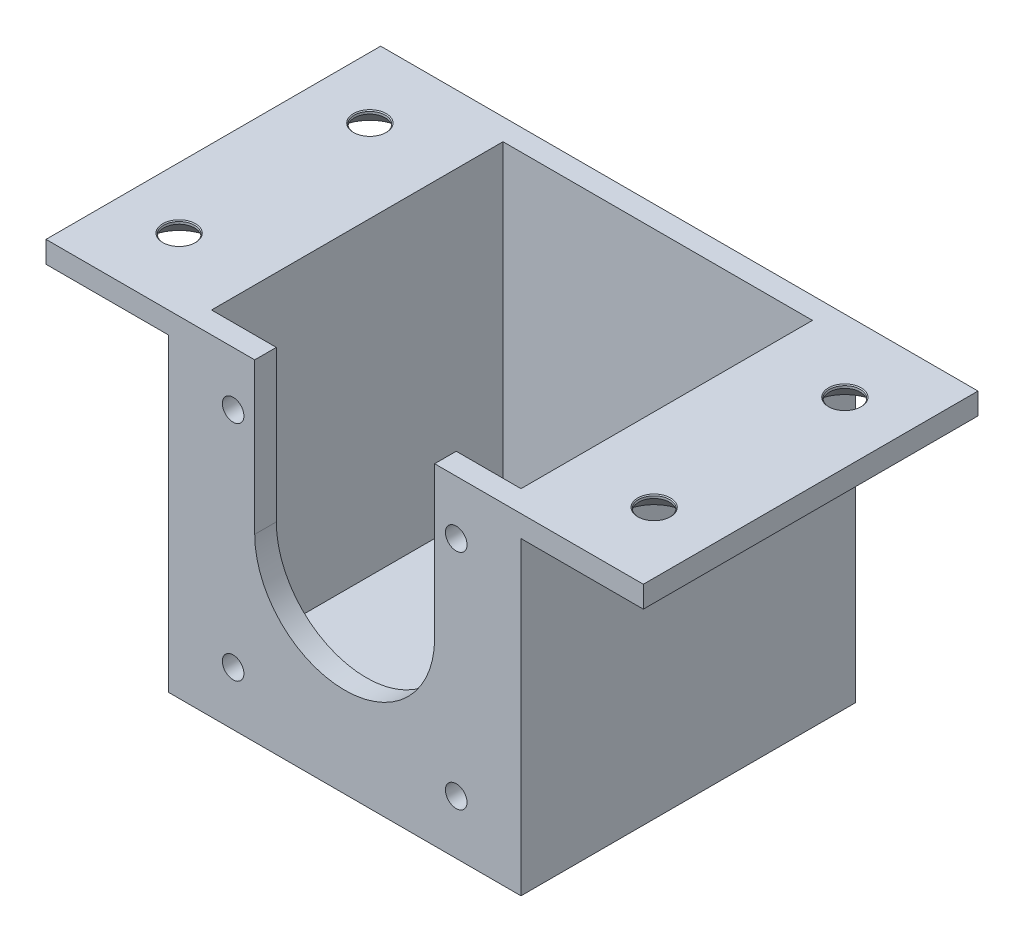
ISO-10303-21;
HEADER;
FILE_DESCRIPTION(('STEP AP214'),'2;1');
FILE_NAME('part.step','',(''),(''),'','','');
FILE_SCHEMA(('AUTOMOTIVE_DESIGN { 1 0 10303 214 1 1 1 1 }'));
ENDSEC;
DATA;
#1=APPLICATION_CONTEXT('core data for automotive mechanical design processes');
#2=APPLICATION_PROTOCOL_DEFINITION('international standard','automotive_design',2000,#1);
#3=PRODUCT_CONTEXT('',#1,'mechanical');
#4=PRODUCT('Part','Part','',(#3));
#5=PRODUCT_RELATED_PRODUCT_CATEGORY('part','',(#4));
#6=PRODUCT_DEFINITION_FORMATION('','',#4);
#7=PRODUCT_DEFINITION_CONTEXT('part definition',#1,'design');
#8=PRODUCT_DEFINITION('design','',#6,#7);
#9=PRODUCT_DEFINITION_SHAPE('','',#8);
#10=(LENGTH_UNIT() NAMED_UNIT(*) SI_UNIT(.MILLI.,.METRE.));
#11=(NAMED_UNIT(*) PLANE_ANGLE_UNIT() SI_UNIT($,.RADIAN.));
#12=(NAMED_UNIT(*) SI_UNIT($,.STERADIAN.) SOLID_ANGLE_UNIT());
#13=UNCERTAINTY_MEASURE_WITH_UNIT(LENGTH_MEASURE(1.E-05),#10,'distance_accuracy_value','');
#14=(GEOMETRIC_REPRESENTATION_CONTEXT(3) GLOBAL_UNCERTAINTY_ASSIGNED_CONTEXT((#13)) GLOBAL_UNIT_ASSIGNED_CONTEXT((#10,
#11,#12)) REPRESENTATION_CONTEXT('',''));
#15=CARTESIAN_POINT('',(0.,0.,0.));
#16=DIRECTION('',(0.,0.,1.));
#17=DIRECTION('',(1.,0.,0.));
#18=AXIS2_PLACEMENT_3D('',#15,#16,#17);
#19=CARTESIAN_POINT('',(0.,0.,46.5));
#20=DIRECTION('',(-1.,0.,0.));
#21=DIRECTION('',(0.,0.,1.));
#22=AXIS2_PLACEMENT_3D('',#19,#20,#21);
#23=PLANE('',#22);
#24=DIRECTION('',(0.,0.,-1.));
#25=VECTOR('',#24,1.);
#26=CARTESIAN_POINT('',(0.,0.,46.5));
#27=LINE('',#26,#25);
#28=CARTESIAN_POINT('',(0.,0.,43.5));
#29=VERTEX_POINT('',#28);
#30=CARTESIAN_POINT('',(0.,0.,3.));
#31=VERTEX_POINT('',#30);
#32=EDGE_CURVE('E394',#29,#31,#27,.T.);
#33=ORIENTED_EDGE('',*,*,#32,.F.);
#34=DIRECTION('',(0.,-1.,0.));
#35=VECTOR('',#34,1.);
#36=CARTESIAN_POINT('',(0.,43.,43.5));
#37=LINE('',#36,#35);
#38=CARTESIAN_POINT('',(0.,43.,43.5));
#39=VERTEX_POINT('',#38);
#40=EDGE_CURVE('E313',#39,#29,#37,.T.);
#41=ORIENTED_EDGE('',*,*,#40,.F.);
#42=DIRECTION('',(0.,0.,-1.));
#43=VECTOR('',#42,1.);
#44=CARTESIAN_POINT('',(0.,43.,46.5));
#45=LINE('',#44,#43);
#46=CARTESIAN_POINT('',(0.,43.,3.));
#47=VERTEX_POINT('',#46);
#48=EDGE_CURVE('E397',#39,#47,#45,.T.);
#49=ORIENTED_EDGE('',*,*,#48,.T.);
#50=DIRECTION('',(0.,-1.,0.));
#51=VECTOR('',#50,1.);
#52=CARTESIAN_POINT('',(0.,43.,3.));
#53=LINE('',#52,#51);
#54=EDGE_CURVE('E325',#47,#31,#53,.T.);
#55=ORIENTED_EDGE('',*,*,#54,.T.);
#56=EDGE_LOOP('',(#33,#41,#49,#55));
#57=FACE_BOUND('',#56,.T.);
#58=ADVANCED_FACE('F32',(#57),#23,.T.);
#59=CARTESIAN_POINT('',(0.,0.,46.5));
#60=DIRECTION('',(0.,1.,0.));
#61=DIRECTION('',(-1.,0.,0.));
#62=AXIS2_PLACEMENT_3D('',#59,#60,#61);
#63=PLANE('',#62);
#64=DIRECTION('',(0.,0.,-1.));
#65=VECTOR('',#64,1.);
#66=CARTESIAN_POINT('',(-8.99999999999999,0.,46.5));
#67=LINE('',#66,#65);
#68=CARTESIAN_POINT('',(-8.99999999999999,0.,15.));
#69=VERTEX_POINT('',#68);
#70=CARTESIAN_POINT('',(-9.,0.,3.));
#71=VERTEX_POINT('',#70);
#72=EDGE_CURVE('E201',#69,#71,#67,.T.);
#73=ORIENTED_EDGE('',*,*,#72,.F.);
#74=DIRECTION('',(1.,0.,0.));
#75=VECTOR('',#74,1.);
#76=CARTESIAN_POINT('',(0.,0.,15.));
#77=LINE('',#76,#75);
#78=CARTESIAN_POINT('',(-34.,0.,15.));
#79=VERTEX_POINT('',#78);
#80=EDGE_CURVE('E211',#79,#69,#77,.T.);
#81=ORIENTED_EDGE('',*,*,#80,.F.);
#82=DIRECTION('',(0.,0.,1.));
#83=VECTOR('',#82,1.);
#84=CARTESIAN_POINT('',(-34.,0.,46.5));
#85=LINE('',#84,#83);
#86=CARTESIAN_POINT('',(-34.,0.,3.));
#87=VERTEX_POINT('',#86);
#88=EDGE_CURVE('E199',#87,#79,#85,.T.);
#89=ORIENTED_EDGE('',*,*,#88,.F.);
#90=DIRECTION('',(1.,0.,0.));
#91=VECTOR('',#90,1.);
#92=CARTESIAN_POINT('',(-43.,0.,3.));
#93=LINE('',#92,#91);
#94=CARTESIAN_POINT('',(-43.,0.,3.));
#95=VERTEX_POINT('',#94);
#96=EDGE_CURVE('E326',#95,#87,#93,.T.);
#97=ORIENTED_EDGE('',*,*,#96,.F.);
#98=DIRECTION('',(0.,0.,-1.));
#99=VECTOR('',#98,1.);
#100=CARTESIAN_POINT('',(-43.,0.,46.5));
#101=LINE('',#100,#99);
#102=CARTESIAN_POINT('',(-43.,0.,43.5));
#103=VERTEX_POINT('',#102);
#104=EDGE_CURVE('E392',#103,#95,#101,.T.);
#105=ORIENTED_EDGE('',*,*,#104,.F.);
#106=DIRECTION('',(-1.,0.,0.));
#107=VECTOR('',#106,1.);
#108=CARTESIAN_POINT('',(-43.,0.,43.5));
#109=LINE('',#108,#107);
#110=EDGE_CURVE('E309',#29,#103,#109,.T.);
#111=ORIENTED_EDGE('',*,*,#110,.F.);
#112=ORIENTED_EDGE('',*,*,#32,.T.);
#113=EDGE_CURVE('E321',#71,#31,#93,.T.);
#114=ORIENTED_EDGE('',*,*,#113,.F.);
#115=EDGE_LOOP('',(#73,#81,#89,#97,#105,#111,#112,#114));
#116=FACE_BOUND('',#115,.T.);
#117=ADVANCED_FACE('F415',(#116),#63,.T.);
#118=CARTESIAN_POINT('',(-43.,0.,46.5));
#119=DIRECTION('',(1.,0.,0.));
#120=DIRECTION('',(0.,0.,-1.));
#121=AXIS2_PLACEMENT_3D('',#118,#119,#120);
#122=PLANE('',#121);
#123=DIRECTION('',(0.,0.,-1.));
#124=VECTOR('',#123,1.);
#125=CARTESIAN_POINT('',(-43.,43.,46.5));
#126=LINE('',#125,#124);
#127=CARTESIAN_POINT('',(-43.,43.,43.5));
#128=VERTEX_POINT('',#127);
#129=CARTESIAN_POINT('',(-43.,43.,3.));
#130=VERTEX_POINT('',#129);
#131=EDGE_CURVE('E390',#128,#130,#126,.T.);
#132=ORIENTED_EDGE('',*,*,#131,.F.);
#133=DIRECTION('',(0.,-1.,0.));
#134=VECTOR('',#133,1.);
#135=CARTESIAN_POINT('',(-43.,43.,43.5));
#136=LINE('',#135,#134);
#137=EDGE_CURVE('E319',#128,#103,#136,.T.);
#138=ORIENTED_EDGE('',*,*,#137,.T.);
#139=ORIENTED_EDGE('',*,*,#104,.T.);
#140=DIRECTION('',(0.,-1.,0.));
#141=VECTOR('',#140,1.);
#142=CARTESIAN_POINT('',(-43.,43.,3.));
#143=LINE('',#142,#141);
#144=EDGE_CURVE('E331',#130,#95,#143,.T.);
#145=ORIENTED_EDGE('',*,*,#144,.F.);
#146=EDGE_LOOP('',(#132,#138,#139,#145));
#147=FACE_BOUND('',#146,.T.);
#148=ADVANCED_FACE('F484',(#147),#122,.T.);
#149=CARTESIAN_POINT('',(0.,40.,46.5));
#150=DIRECTION('',(0.,1.,0.));
#151=DIRECTION('',(-1.,0.,0.));
#152=AXIS2_PLACEMENT_3D('',#149,#150,#151);
#153=PLANE('',#152);
#154=CARTESIAN_POINT('',(11.5,40.,10.));
#155=DIRECTION('',(0.,-1.,0.));
#156=DIRECTION('',(0.,0.,-1.));
#157=AXIS2_PLACEMENT_3D('',#154,#155,#156);
#158=CIRCLE('',#157,4.7);
#159=CARTESIAN_POINT('',(11.5,40.,5.3));
#160=VERTEX_POINT('',#159);
#161=EDGE_CURVE('E216',#160,#160,#158,.T.);
#162=ORIENTED_EDGE('',*,*,#161,.F.);
#163=EDGE_LOOP('',(#162));
#164=FACE_BOUND('',#163,.T.);
#165=CARTESIAN_POINT('',(11.5,40.,36.5));
#166=DIRECTION('',(0.,-1.,0.));
#167=DIRECTION('',(0.,0.,-1.));
#168=AXIS2_PLACEMENT_3D('',#165,#166,#167);
#169=CIRCLE('',#168,4.7);
#170=CARTESIAN_POINT('',(11.5,40.,31.8));
#171=VERTEX_POINT('',#170);
#172=EDGE_CURVE('E228',#171,#171,#169,.T.);
#173=ORIENTED_EDGE('',*,*,#172,.F.);
#174=EDGE_LOOP('',(#173));
#175=FACE_BOUND('',#174,.T.);
#176=DIRECTION('',(1.,0.,0.));
#177=VECTOR('',#176,1.);
#178=CARTESIAN_POINT('',(0.,40.,0.));
#179=LINE('',#178,#177);
#180=CARTESIAN_POINT('',(3.,40.,0.));
#181=VERTEX_POINT('',#180);
#182=CARTESIAN_POINT('',(20.,40.,0.));
#183=VERTEX_POINT('',#182);
#184=EDGE_CURVE('E334',#181,#183,#179,.T.);
#185=ORIENTED_EDGE('',*,*,#184,.T.);
#186=DIRECTION('',(0.,0.,-1.));
#187=VECTOR('',#186,1.);
#188=CARTESIAN_POINT('',(20.,40.,46.5));
#189=LINE('',#188,#187);
#190=CARTESIAN_POINT('',(20.,40.,46.5));
#191=VERTEX_POINT('',#190);
#192=EDGE_CURVE('E402',#191,#183,#189,.T.);
#193=ORIENTED_EDGE('',*,*,#192,.F.);
#194=DIRECTION('',(1.,0.,0.));
#195=VECTOR('',#194,1.);
#196=CARTESIAN_POINT('',(0.,40.,46.5));
#197=LINE('',#196,#195);
#198=CARTESIAN_POINT('',(3.,40.,46.5));
#199=VERTEX_POINT('',#198);
#200=EDGE_CURVE('E335',#199,#191,#197,.T.);
#201=ORIENTED_EDGE('',*,*,#200,.F.);
#202=DIRECTION('',(0.,0.,-1.));
#203=VECTOR('',#202,1.);
#204=CARTESIAN_POINT('',(3.,40.,46.5));
#205=LINE('',#204,#203);
#206=EDGE_CURVE('E356',#199,#181,#205,.T.);
#207=ORIENTED_EDGE('',*,*,#206,.T.);
#208=EDGE_LOOP('',(#185,#193,#201,#207));
#209=FACE_BOUND('',#208,.T.);
#210=ADVANCED_FACE('F34',(#164,#175,#209),#153,.F.);
#211=CARTESIAN_POINT('',(20.,43.,46.5));
#212=DIRECTION('',(1.,0.,0.));
#213=DIRECTION('',(0.,0.,-1.));
#214=AXIS2_PLACEMENT_3D('',#211,#212,#213);
#215=PLANE('',#214);
#216=DIRECTION('',(0.,-1.,0.));
#217=VECTOR('',#216,1.);
#218=CARTESIAN_POINT('',(20.,43.,0.));
#219=LINE('',#218,#217);
#220=CARTESIAN_POINT('',(20.,43.,0.));
#221=VERTEX_POINT('',#220);
#222=EDGE_CURVE('E359',#221,#183,#219,.T.);
#223=ORIENTED_EDGE('',*,*,#222,.F.);
#224=DIRECTION('',(0.,0.,-1.));
#225=VECTOR('',#224,1.);
#226=CARTESIAN_POINT('',(20.,43.,46.5));
#227=LINE('',#226,#225);
#228=CARTESIAN_POINT('',(20.,43.,46.5));
#229=VERTEX_POINT('',#228);
#230=EDGE_CURVE('E399',#229,#221,#227,.T.);
#231=ORIENTED_EDGE('',*,*,#230,.F.);
#232=DIRECTION('',(0.,-1.,0.));
#233=VECTOR('',#232,1.);
#234=CARTESIAN_POINT('',(20.,43.,46.5));
#235=LINE('',#234,#233);
#236=EDGE_CURVE('E337',#229,#191,#235,.T.);
#237=ORIENTED_EDGE('',*,*,#236,.T.);
#238=ORIENTED_EDGE('',*,*,#192,.T.);
#239=EDGE_LOOP('',(#223,#231,#237,#238));
#240=FACE_BOUND('',#239,.T.);
#241=ADVANCED_FACE('F454',(#240),#215,.T.);
#242=CARTESIAN_POINT('',(-43.,43.,46.5));
#243=DIRECTION('',(0.,1.,0.));
#244=DIRECTION('',(0.,0.,1.));
#245=AXIS2_PLACEMENT_3D('',#242,#243,#244);
#246=PLANE('',#245);
#247=CARTESIAN_POINT('',(11.5,43.,10.));
#248=DIRECTION('',(0.,-1.,0.));
#249=DIRECTION('',(0.,0.,-1.));
#250=AXIS2_PLACEMENT_3D('',#247,#248,#249);
#251=CIRCLE('',#250,2.275);
#252=CARTESIAN_POINT('',(11.5,43.,7.725));
#253=VERTEX_POINT('',#252);
#254=EDGE_CURVE('E213',#253,#253,#251,.T.);
#255=ORIENTED_EDGE('',*,*,#254,.T.);
#256=EDGE_LOOP('',(#255));
#257=FACE_BOUND('',#256,.T.);
#258=CARTESIAN_POINT('',(11.5,43.,36.5));
#259=DIRECTION('',(0.,-1.,0.));
#260=DIRECTION('',(0.,0.,-1.));
#261=AXIS2_PLACEMENT_3D('',#258,#259,#260);
#262=CIRCLE('',#261,2.275);
#263=CARTESIAN_POINT('',(11.5,43.,34.225));
#264=VERTEX_POINT('',#263);
#265=EDGE_CURVE('E225',#264,#264,#262,.T.);
#266=ORIENTED_EDGE('',*,*,#265,.T.);
#267=EDGE_LOOP('',(#266));
#268=FACE_BOUND('',#267,.T.);
#269=CARTESIAN_POINT('',(-54.5,43.,10.));
#270=DIRECTION('',(0.,-1.,0.));
#271=DIRECTION('',(0.,0.,-1.));
#272=AXIS2_PLACEMENT_3D('',#269,#270,#271);
#273=CIRCLE('',#272,2.275);
#274=CARTESIAN_POINT('',(-54.5,43.,7.725));
#275=VERTEX_POINT('',#274);
#276=EDGE_CURVE('E237',#275,#275,#273,.T.);
#277=ORIENTED_EDGE('',*,*,#276,.T.);
#278=EDGE_LOOP('',(#277));
#279=FACE_BOUND('',#278,.T.);
#280=CARTESIAN_POINT('',(-54.5,43.,36.5));
#281=DIRECTION('',(0.,-1.,0.));
#282=DIRECTION('',(0.,0.,-1.));
#283=AXIS2_PLACEMENT_3D('',#280,#281,#282);
#284=CIRCLE('',#283,2.275);
#285=CARTESIAN_POINT('',(-54.5,43.,34.225));
#286=VERTEX_POINT('',#285);
#287=EDGE_CURVE('E249',#286,#286,#284,.T.);
#288=ORIENTED_EDGE('',*,*,#287,.T.);
#289=EDGE_LOOP('',(#288));
#290=FACE_BOUND('',#289,.T.);
#291=DIRECTION('',(0.,0.,1.));
#292=VECTOR('',#291,1.);
#293=CARTESIAN_POINT('',(-9.,43.,-0.001000000000001));
#294=LINE('',#293,#292);
#295=CARTESIAN_POINT('',(-9.,43.,43.5));
#296=VERTEX_POINT('',#295);
#297=CARTESIAN_POINT('',(-9.,43.,46.5));
#298=VERTEX_POINT('',#297);
#299=EDGE_CURVE('E304',#296,#298,#294,.T.);
#300=ORIENTED_EDGE('',*,*,#299,.T.);
#301=DIRECTION('',(1.,0.,0.));
#302=VECTOR('',#301,1.);
#303=CARTESIAN_POINT('',(0.,43.,46.5));
#304=LINE('',#303,#302);
#305=EDGE_CURVE('E341',#298,#229,#304,.T.);
#306=ORIENTED_EDGE('',*,*,#305,.T.);
#307=ORIENTED_EDGE('',*,*,#230,.T.);
#308=DIRECTION('',(1.,0.,0.));
#309=VECTOR('',#308,1.);
#310=CARTESIAN_POINT('',(-43.,43.,0.));
#311=LINE('',#310,#309);
#312=CARTESIAN_POINT('',(-63.,43.,0.));
#313=VERTEX_POINT('',#312);
#314=EDGE_CURVE('E362',#313,#221,#311,.T.);
#315=ORIENTED_EDGE('',*,*,#314,.F.);
#316=DIRECTION('',(0.,0.,-1.));
#317=VECTOR('',#316,1.);
#318=CARTESIAN_POINT('',(-63.,43.,46.5));
#319=LINE('',#318,#317);
#320=CARTESIAN_POINT('',(-63.,43.,46.5));
#321=VERTEX_POINT('',#320);
#322=EDGE_CURVE('E388',#321,#313,#319,.T.);
#323=ORIENTED_EDGE('',*,*,#322,.F.);
#324=CARTESIAN_POINT('',(-34.,43.,46.5));
#325=VERTEX_POINT('',#324);
#326=EDGE_CURVE('E342',#321,#325,#304,.T.);
#327=ORIENTED_EDGE('',*,*,#326,.T.);
#328=DIRECTION('',(0.,0.,1.));
#329=VECTOR('',#328,1.);
#330=CARTESIAN_POINT('',(-34.,43.,-0.001000000000001));
#331=LINE('',#330,#329);
#332=CARTESIAN_POINT('',(-34.,43.,43.5));
#333=VERTEX_POINT('',#332);
#334=EDGE_CURVE('E301',#333,#325,#331,.T.);
#335=ORIENTED_EDGE('',*,*,#334,.F.);
#336=DIRECTION('',(-1.,0.,0.));
#337=VECTOR('',#336,1.);
#338=CARTESIAN_POINT('',(-43.,43.,43.5));
#339=LINE('',#338,#337);
#340=EDGE_CURVE('E314',#333,#128,#339,.T.);
#341=ORIENTED_EDGE('',*,*,#340,.T.);
#342=ORIENTED_EDGE('',*,*,#131,.T.);
#343=DIRECTION('',(1.,0.,0.));
#344=VECTOR('',#343,1.);
#345=CARTESIAN_POINT('',(-43.,43.,3.));
#346=LINE('',#345,#344);
#347=EDGE_CURVE('E322',#130,#47,#346,.T.);
#348=ORIENTED_EDGE('',*,*,#347,.T.);
#349=ORIENTED_EDGE('',*,*,#48,.F.);
#350=EDGE_CURVE('E310',#39,#296,#339,.T.);
#351=ORIENTED_EDGE('',*,*,#350,.T.);
#352=EDGE_LOOP('',(#300,#306,#307,#315,#323,#327,#335,#341,#342,#348,#349,#351));
#353=FACE_BOUND('',#352,.T.);
#354=ADVANCED_FACE('F449',(#257,#268,#279,#290,#353),#246,.T.);
#355=CARTESIAN_POINT('',(-63.,40.,46.5));
#356=DIRECTION('',(-1.,0.,0.));
#357=DIRECTION('',(0.,0.,1.));
#358=AXIS2_PLACEMENT_3D('',#355,#356,#357);
#359=PLANE('',#358);
#360=DIRECTION('',(0.,1.,0.));
#361=VECTOR('',#360,1.);
#362=CARTESIAN_POINT('',(-63.,40.,0.));
#363=LINE('',#362,#361);
#364=CARTESIAN_POINT('',(-63.,40.,0.));
#365=VERTEX_POINT('',#364);
#366=EDGE_CURVE('E364',#365,#313,#363,.T.);
#367=ORIENTED_EDGE('',*,*,#366,.F.);
#368=DIRECTION('',(0.,0.,-1.));
#369=VECTOR('',#368,1.);
#370=CARTESIAN_POINT('',(-63.,40.,46.5));
#371=LINE('',#370,#369);
#372=CARTESIAN_POINT('',(-63.,40.,46.5));
#373=VERTEX_POINT('',#372);
#374=EDGE_CURVE('E386',#373,#365,#371,.T.);
#375=ORIENTED_EDGE('',*,*,#374,.F.);
#376=DIRECTION('',(0.,1.,0.));
#377=VECTOR('',#376,1.);
#378=CARTESIAN_POINT('',(-63.,40.,46.5));
#379=LINE('',#378,#377);
#380=EDGE_CURVE('E345',#373,#321,#379,.T.);
#381=ORIENTED_EDGE('',*,*,#380,.T.);
#382=ORIENTED_EDGE('',*,*,#322,.T.);
#383=EDGE_LOOP('',(#367,#375,#381,#382));
#384=FACE_BOUND('',#383,.T.);
#385=ADVANCED_FACE('F443',(#384),#359,.T.);
#386=CARTESIAN_POINT('',(-43.,40.,46.5));
#387=DIRECTION('',(0.,1.,0.));
#388=DIRECTION('',(0.,0.,1.));
#389=AXIS2_PLACEMENT_3D('',#386,#387,#388);
#390=PLANE('',#389);
#391=CARTESIAN_POINT('',(-54.5,40.,10.));
#392=DIRECTION('',(0.,-1.,0.));
#393=DIRECTION('',(0.,0.,-1.));
#394=AXIS2_PLACEMENT_3D('',#391,#392,#393);
#395=CIRCLE('',#394,4.7);
#396=CARTESIAN_POINT('',(-54.5,40.,5.3));
#397=VERTEX_POINT('',#396);
#398=EDGE_CURVE('E240',#397,#397,#395,.T.);
#399=ORIENTED_EDGE('',*,*,#398,.F.);
#400=EDGE_LOOP('',(#399));
#401=FACE_BOUND('',#400,.T.);
#402=CARTESIAN_POINT('',(-54.5,40.,36.5));
#403=DIRECTION('',(0.,-1.,0.));
#404=DIRECTION('',(0.,0.,-1.));
#405=AXIS2_PLACEMENT_3D('',#402,#403,#404);
#406=CIRCLE('',#405,4.7);
#407=CARTESIAN_POINT('',(-54.5,40.,31.8));
#408=VERTEX_POINT('',#407);
#409=EDGE_CURVE('E252',#408,#408,#406,.T.);
#410=ORIENTED_EDGE('',*,*,#409,.F.);
#411=EDGE_LOOP('',(#410));
#412=FACE_BOUND('',#411,.T.);
#413=DIRECTION('',(1.,0.,0.));
#414=VECTOR('',#413,1.);
#415=CARTESIAN_POINT('',(-43.,40.,0.));
#416=LINE('',#415,#414);
#417=CARTESIAN_POINT('',(-46.,40.,0.));
#418=VERTEX_POINT('',#417);
#419=EDGE_CURVE('E367',#365,#418,#416,.T.);
#420=ORIENTED_EDGE('',*,*,#419,.T.);
#421=DIRECTION('',(0.,0.,-1.));
#422=VECTOR('',#421,1.);
#423=CARTESIAN_POINT('',(-46.,40.,46.5));
#424=LINE('',#423,#422);
#425=CARTESIAN_POINT('',(-46.,40.,46.5));
#426=VERTEX_POINT('',#425);
#427=EDGE_CURVE('E383',#426,#418,#424,.T.);
#428=ORIENTED_EDGE('',*,*,#427,.F.);
#429=DIRECTION('',(1.,0.,0.));
#430=VECTOR('',#429,1.);
#431=CARTESIAN_POINT('',(-43.,40.,46.5));
#432=LINE('',#431,#430);
#433=EDGE_CURVE('E348',#373,#426,#432,.T.);
#434=ORIENTED_EDGE('',*,*,#433,.F.);
#435=ORIENTED_EDGE('',*,*,#374,.T.);
#436=EDGE_LOOP('',(#420,#428,#434,#435));
#437=FACE_BOUND('',#436,.T.);
#438=ADVANCED_FACE('F466',(#401,#412,#437),#390,.F.);
#439=CARTESIAN_POINT('',(-46.,0.,46.5));
#440=DIRECTION('',(1.,0.,0.));
#441=DIRECTION('',(0.,0.,-1.));
#442=AXIS2_PLACEMENT_3D('',#439,#440,#441);
#443=PLANE('',#442);
#444=DIRECTION('',(0.,1.,0.));
#445=VECTOR('',#444,1.);
#446=CARTESIAN_POINT('',(-46.,0.,0.));
#447=LINE('',#446,#445);
#448=CARTESIAN_POINT('',(-46.,-3.00000000000001,0.));
#449=VERTEX_POINT('',#448);
#450=EDGE_CURVE('E369',#418,#449,#447,.F.);
#451=ORIENTED_EDGE('',*,*,#450,.T.);
#452=DIRECTION('',(0.,0.,-1.));
#453=VECTOR('',#452,1.);
#454=CARTESIAN_POINT('',(-46.,-3.00000000000001,46.5));
#455=LINE('',#454,#453);
#456=CARTESIAN_POINT('',(-46.,-3.00000000000001,46.5));
#457=VERTEX_POINT('',#456);
#458=EDGE_CURVE('E380',#457,#449,#455,.T.);
#459=ORIENTED_EDGE('',*,*,#458,.F.);
#460=DIRECTION('',(0.,1.,0.));
#461=VECTOR('',#460,1.);
#462=CARTESIAN_POINT('',(-46.,0.,46.5));
#463=LINE('',#462,#461);
#464=EDGE_CURVE('E350',#426,#457,#463,.F.);
#465=ORIENTED_EDGE('',*,*,#464,.F.);
#466=ORIENTED_EDGE('',*,*,#427,.T.);
#467=EDGE_LOOP('',(#451,#459,#465,#466));
#468=FACE_BOUND('',#467,.T.);
#469=ADVANCED_FACE('F437',(#468),#443,.F.);
#470=CARTESIAN_POINT('',(0.,-3.,46.5));
#471=DIRECTION('',(0.,1.,0.));
#472=DIRECTION('',(-1.,0.,0.));
#473=AXIS2_PLACEMENT_3D('',#470,#471,#472);
#474=PLANE('',#473);
#475=DIRECTION('',(-1.,0.,0.));
#476=VECTOR('',#475,1.);
#477=CARTESIAN_POINT('',(-8.99999999999999,-3.,15.));
#478=LINE('',#477,#476);
#479=CARTESIAN_POINT('',(-8.99999999999999,-3.,15.));
#480=VERTEX_POINT('',#479);
#481=CARTESIAN_POINT('',(-34.,-3.,15.));
#482=VERTEX_POINT('',#481);
#483=EDGE_CURVE('E425',#480,#482,#478,.T.);
#484=ORIENTED_EDGE('',*,*,#483,.F.);
#485=DIRECTION('',(0.,0.,1.));
#486=VECTOR('',#485,1.);
#487=CARTESIAN_POINT('',(-8.99999999999999,-3.,0.));
#488=LINE('',#487,#486);
#489=CARTESIAN_POINT('',(-8.99999999999999,-3.,0.));
#490=VERTEX_POINT('',#489);
#491=EDGE_CURVE('E422',#490,#480,#488,.T.);
#492=ORIENTED_EDGE('',*,*,#491,.F.);
#493=DIRECTION('',(1.,0.,0.));
#494=VECTOR('',#493,1.);
#495=CARTESIAN_POINT('',(0.,-3.,0.));
#496=LINE('',#495,#494);
#497=CARTESIAN_POINT('',(3.,-3.,0.));
#498=VERTEX_POINT('',#497);
#499=EDGE_CURVE('E198',#490,#498,#496,.T.);
#500=ORIENTED_EDGE('',*,*,#499,.T.);
#501=DIRECTION('',(0.,0.,-1.));
#502=VECTOR('',#501,1.);
#503=CARTESIAN_POINT('',(3.,-3.,46.5));
#504=LINE('',#503,#502);
#505=CARTESIAN_POINT('',(3.,-3.,46.5));
#506=VERTEX_POINT('',#505);
#507=EDGE_CURVE('E377',#506,#498,#504,.T.);
#508=ORIENTED_EDGE('',*,*,#507,.F.);
#509=DIRECTION('',(1.,0.,0.));
#510=VECTOR('',#509,1.);
#511=CARTESIAN_POINT('',(0.,-3.,46.5));
#512=LINE('',#511,#510);
#513=EDGE_CURVE('E352',#457,#506,#512,.T.);
#514=ORIENTED_EDGE('',*,*,#513,.F.);
#515=ORIENTED_EDGE('',*,*,#458,.T.);
#516=CARTESIAN_POINT('',(-34.,-3.,0.));
#517=VERTEX_POINT('',#516);
#518=EDGE_CURVE('E371',#449,#517,#496,.T.);
#519=ORIENTED_EDGE('',*,*,#518,.T.);
#520=DIRECTION('',(0.,0.,-1.));
#521=VECTOR('',#520,1.);
#522=CARTESIAN_POINT('',(-34.,-3.,0.));
#523=LINE('',#522,#521);
#524=EDGE_CURVE('E187',#482,#517,#523,.T.);
#525=ORIENTED_EDGE('',*,*,#524,.F.);
#526=EDGE_LOOP('',(#484,#492,#500,#508,#514,#515,#519,#525));
#527=FACE_BOUND('',#526,.T.);
#528=ADVANCED_FACE('F428',(#527),#474,.F.);
#529=CARTESIAN_POINT('',(3.,0.,46.5));
#530=DIRECTION('',(-1.,0.,0.));
#531=DIRECTION('',(0.,0.,1.));
#532=AXIS2_PLACEMENT_3D('',#529,#530,#531);
#533=PLANE('',#532);
#534=DIRECTION('',(0.,1.,0.));
#535=VECTOR('',#534,1.);
#536=CARTESIAN_POINT('',(3.,0.,0.));
#537=LINE('',#536,#535);
#538=EDGE_CURVE('E338',#498,#181,#537,.T.);
#539=ORIENTED_EDGE('',*,*,#538,.T.);
#540=ORIENTED_EDGE('',*,*,#206,.F.);
#541=DIRECTION('',(0.,1.,0.));
#542=VECTOR('',#541,1.);
#543=CARTESIAN_POINT('',(3.,0.,46.5));
#544=LINE('',#543,#542);
#545=EDGE_CURVE('E354',#506,#199,#544,.T.);
#546=ORIENTED_EDGE('',*,*,#545,.F.);
#547=ORIENTED_EDGE('',*,*,#507,.T.);
#548=EDGE_LOOP('',(#539,#540,#546,#547));
#549=FACE_BOUND('',#548,.T.);
#550=ADVANCED_FACE('F462',(#549),#533,.F.);
#551=CARTESIAN_POINT('',(0.,0.,46.5));
#552=DIRECTION('',(0.,0.,-1.));
#553=DIRECTION('',(-1.,0.,0.));
#554=AXIS2_PLACEMENT_3D('',#551,#552,#553);
#555=PLANE('',#554);
#556=CARTESIAN_POINT('',(-6.,4.5,46.5));
#557=DIRECTION('',(0.,0.,1.));
#558=DIRECTION('',(1.,0.,0.));
#559=AXIS2_PLACEMENT_3D('',#556,#557,#558);
#560=CIRCLE('',#559,1.5);
#561=CARTESIAN_POINT('',(-4.5,4.5,46.5));
#562=VERTEX_POINT('',#561);
#563=EDGE_CURVE('E279',#562,#562,#560,.T.);
#564=ORIENTED_EDGE('',*,*,#563,.F.);
#565=EDGE_LOOP('',(#564));
#566=FACE_BOUND('',#565,.T.);
#567=CARTESIAN_POINT('',(-6.,35.5,46.5));
#568=DIRECTION('',(0.,0.,1.));
#569=DIRECTION('',(1.,0.,0.));
#570=AXIS2_PLACEMENT_3D('',#567,#568,#569);
#571=CIRCLE('',#570,1.5);
#572=CARTESIAN_POINT('',(-4.5,35.5,46.5));
#573=VERTEX_POINT('',#572);
#574=EDGE_CURVE('E273',#573,#573,#571,.T.);
#575=ORIENTED_EDGE('',*,*,#574,.F.);
#576=EDGE_LOOP('',(#575));
#577=FACE_BOUND('',#576,.T.);
#578=CARTESIAN_POINT('',(-37.,35.5,46.5));
#579=DIRECTION('',(0.,0.,1.));
#580=DIRECTION('',(1.,0.,0.));
#581=AXIS2_PLACEMENT_3D('',#578,#579,#580);
#582=CIRCLE('',#581,1.5);
#583=CARTESIAN_POINT('',(-35.5,35.5,46.5));
#584=VERTEX_POINT('',#583);
#585=EDGE_CURVE('E266',#584,#584,#582,.T.);
#586=ORIENTED_EDGE('',*,*,#585,.F.);
#587=EDGE_LOOP('',(#586));
#588=FACE_BOUND('',#587,.T.);
#589=CARTESIAN_POINT('',(-37.,4.49999999999999,46.5));
#590=DIRECTION('',(0.,0.,1.));
#591=DIRECTION('',(1.,0.,0.));
#592=AXIS2_PLACEMENT_3D('',#589,#590,#591);
#593=CIRCLE('',#592,1.5);
#594=CARTESIAN_POINT('',(-35.5,4.49999999999999,46.5));
#595=VERTEX_POINT('',#594);
#596=EDGE_CURVE('E265',#595,#595,#593,.T.);
#597=ORIENTED_EDGE('',*,*,#596,.F.);
#598=EDGE_LOOP('',(#597));
#599=FACE_BOUND('',#598,.T.);
#600=ORIENTED_EDGE('',*,*,#305,.F.);
#601=DIRECTION('',(0.,1.,0.));
#602=VECTOR('',#601,1.);
#603=CARTESIAN_POINT('',(-9.,43.,46.5));
#604=LINE('',#603,#602);
#605=CARTESIAN_POINT('',(-9.,22.,46.5));
#606=VERTEX_POINT('',#605);
#607=EDGE_CURVE('E288',#606,#298,#604,.T.);
#608=ORIENTED_EDGE('',*,*,#607,.F.);
#609=CARTESIAN_POINT('',(-21.5,22.,46.5));
#610=DIRECTION('',(0.,0.,1.));
#611=DIRECTION('',(-1.,0.,0.));
#612=AXIS2_PLACEMENT_3D('',#609,#610,#611);
#613=CIRCLE('',#612,12.5);
#614=CARTESIAN_POINT('',(-34.,22.,46.5));
#615=VERTEX_POINT('',#614);
#616=EDGE_CURVE('E291',#615,#606,#613,.T.);
#617=ORIENTED_EDGE('',*,*,#616,.F.);
#618=DIRECTION('',(0.,-1.,0.));
#619=VECTOR('',#618,1.);
#620=CARTESIAN_POINT('',(-34.,43.,46.5));
#621=LINE('',#620,#619);
#622=EDGE_CURVE('E294',#325,#615,#621,.T.);
#623=ORIENTED_EDGE('',*,*,#622,.F.);
#624=ORIENTED_EDGE('',*,*,#326,.F.);
#625=ORIENTED_EDGE('',*,*,#380,.F.);
#626=ORIENTED_EDGE('',*,*,#433,.T.);
#627=ORIENTED_EDGE('',*,*,#464,.T.);
#628=ORIENTED_EDGE('',*,*,#513,.T.);
#629=ORIENTED_EDGE('',*,*,#545,.T.);
#630=ORIENTED_EDGE('',*,*,#200,.T.);
#631=ORIENTED_EDGE('',*,*,#236,.F.);
#632=EDGE_LOOP('',(#600,#608,#617,#623,#624,#625,#626,#627,#628,#629,#630,#631));
#633=FACE_BOUND('',#632,.T.);
#634=ADVANCED_FACE('F465',(#566,#577,#588,#599,#633),#555,.F.);
#635=CARTESIAN_POINT('',(0.,0.,0.));
#636=DIRECTION('',(0.,0.,-1.));
#637=DIRECTION('',(-1.,0.,0.));
#638=AXIS2_PLACEMENT_3D('',#635,#636,#637);
#639=PLANE('',#638);
#640=DIRECTION('',(0.,-1.,0.));
#641=VECTOR('',#640,1.);
#642=CARTESIAN_POINT('',(-8.99999999999999,2.,0.));
#643=LINE('',#642,#641);
#644=CARTESIAN_POINT('',(-8.99999999999999,2.,0.));
#645=VERTEX_POINT('',#644);
#646=EDGE_CURVE('E183',#645,#490,#643,.T.);
#647=ORIENTED_EDGE('',*,*,#646,.F.);
#648=DIRECTION('',(1.,0.,0.));
#649=VECTOR('',#648,1.);
#650=CARTESIAN_POINT('',(-8.99999999999999,2.,0.));
#651=LINE('',#650,#649);
#652=CARTESIAN_POINT('',(-34.,2.,0.));
#653=VERTEX_POINT('',#652);
#654=EDGE_CURVE('E190',#653,#645,#651,.T.);
#655=ORIENTED_EDGE('',*,*,#654,.F.);
#656=DIRECTION('',(0.,-1.,0.));
#657=VECTOR('',#656,1.);
#658=CARTESIAN_POINT('',(-34.,2.,0.));
#659=LINE('',#658,#657);
#660=EDGE_CURVE('E47',#653,#517,#659,.T.);
#661=ORIENTED_EDGE('',*,*,#660,.T.);
#662=ORIENTED_EDGE('',*,*,#518,.F.);
#663=ORIENTED_EDGE('',*,*,#450,.F.);
#664=ORIENTED_EDGE('',*,*,#419,.F.);
#665=ORIENTED_EDGE('',*,*,#366,.T.);
#666=ORIENTED_EDGE('',*,*,#314,.T.);
#667=ORIENTED_EDGE('',*,*,#222,.T.);
#668=ORIENTED_EDGE('',*,*,#184,.F.);
#669=ORIENTED_EDGE('',*,*,#538,.F.);
#670=ORIENTED_EDGE('',*,*,#499,.F.);
#671=EDGE_LOOP('',(#647,#655,#661,#662,#663,#664,#665,#666,#667,#668,#669,#670));
#672=FACE_BOUND('',#671,.T.);
#673=ADVANCED_FACE('F196',(#672),#639,.T.);
#674=CARTESIAN_POINT('',(-43.,43.,3.));
#675=DIRECTION('',(0.,0.,-1.));
#676=DIRECTION('',(-1.,0.,0.));
#677=AXIS2_PLACEMENT_3D('',#674,#675,#676);
#678=PLANE('',#677);
#679=DIRECTION('',(-1.,0.,0.));
#680=VECTOR('',#679,1.);
#681=CARTESIAN_POINT('',(-43.,1.99999999999999,3.));
#682=LINE('',#681,#680);
#683=CARTESIAN_POINT('',(-8.99999999999999,2.,3.));
#684=VERTEX_POINT('',#683);
#685=CARTESIAN_POINT('',(-34.,2.,3.));
#686=VERTEX_POINT('',#685);
#687=EDGE_CURVE('E404',#684,#686,#682,.T.);
#688=ORIENTED_EDGE('',*,*,#687,.F.);
#689=DIRECTION('',(0.,-1.,0.));
#690=VECTOR('',#689,1.);
#691=CARTESIAN_POINT('',(-9.,43.,3.));
#692=LINE('',#691,#690);
#693=EDGE_CURVE('E11',#684,#71,#692,.T.);
#694=ORIENTED_EDGE('',*,*,#693,.T.);
#695=ORIENTED_EDGE('',*,*,#113,.T.);
#696=ORIENTED_EDGE('',*,*,#54,.F.);
#697=ORIENTED_EDGE('',*,*,#347,.F.);
#698=ORIENTED_EDGE('',*,*,#144,.T.);
#699=ORIENTED_EDGE('',*,*,#96,.T.);
#700=DIRECTION('',(0.,1.,0.));
#701=VECTOR('',#700,1.);
#702=CARTESIAN_POINT('',(-34.,43.,3.));
#703=LINE('',#702,#701);
#704=EDGE_CURVE('E40',#87,#686,#703,.T.);
#705=ORIENTED_EDGE('',*,*,#704,.T.);
#706=EDGE_LOOP('',(#688,#694,#695,#696,#697,#698,#699,#705));
#707=FACE_BOUND('',#706,.T.);
#708=ADVANCED_FACE('F407',(#707),#678,.F.);
#709=CARTESIAN_POINT('',(-43.,43.,43.5));
#710=DIRECTION('',(0.,0.,1.));
#711=DIRECTION('',(1.,0.,0.));
#712=AXIS2_PLACEMENT_3D('',#709,#710,#711);
#713=PLANE('',#712);
#714=CARTESIAN_POINT('',(-6.,4.5,43.5));
#715=DIRECTION('',(0.,0.,1.));
#716=DIRECTION('',(1.,0.,0.));
#717=AXIS2_PLACEMENT_3D('',#714,#715,#716);
#718=CIRCLE('',#717,1.5);
#719=CARTESIAN_POINT('',(-4.5,4.5,43.5));
#720=VERTEX_POINT('',#719);
#721=EDGE_CURVE('E261',#720,#720,#718,.F.);
#722=ORIENTED_EDGE('',*,*,#721,.F.);
#723=EDGE_LOOP('',(#722));
#724=FACE_BOUND('',#723,.T.);
#725=CARTESIAN_POINT('',(-6.,35.5,43.5));
#726=DIRECTION('',(0.,0.,1.));
#727=DIRECTION('',(1.,0.,0.));
#728=AXIS2_PLACEMENT_3D('',#725,#726,#727);
#729=CIRCLE('',#728,1.5);
#730=CARTESIAN_POINT('',(-4.5,35.5,43.5));
#731=VERTEX_POINT('',#730);
#732=EDGE_CURVE('E276',#731,#731,#729,.F.);
#733=ORIENTED_EDGE('',*,*,#732,.F.);
#734=EDGE_LOOP('',(#733));
#735=FACE_BOUND('',#734,.T.);
#736=CARTESIAN_POINT('',(-37.,35.5,43.5));
#737=DIRECTION('',(0.,0.,1.));
#738=DIRECTION('',(1.,0.,0.));
#739=AXIS2_PLACEMENT_3D('',#736,#737,#738);
#740=CIRCLE('',#739,1.5);
#741=CARTESIAN_POINT('',(-35.5,35.5,43.5));
#742=VERTEX_POINT('',#741);
#743=EDGE_CURVE('E270',#742,#742,#740,.F.);
#744=ORIENTED_EDGE('',*,*,#743,.F.);
#745=EDGE_LOOP('',(#744));
#746=FACE_BOUND('',#745,.T.);
#747=CARTESIAN_POINT('',(-37.,4.49999999999999,43.5));
#748=DIRECTION('',(0.,0.,1.));
#749=DIRECTION('',(1.,0.,0.));
#750=AXIS2_PLACEMENT_3D('',#747,#748,#749);
#751=CIRCLE('',#750,1.5);
#752=CARTESIAN_POINT('',(-35.5,4.49999999999999,43.5));
#753=VERTEX_POINT('',#752);
#754=EDGE_CURVE('E262',#753,#753,#751,.F.);
#755=ORIENTED_EDGE('',*,*,#754,.F.);
#756=EDGE_LOOP('',(#755));
#757=FACE_BOUND('',#756,.T.);
#758=CARTESIAN_POINT('',(-21.5,22.,43.5));
#759=DIRECTION('',(0.,0.,1.));
#760=DIRECTION('',(1.,0.,0.));
#761=AXIS2_PLACEMENT_3D('',#758,#759,#760);
#762=CIRCLE('',#761,12.5);
#763=CARTESIAN_POINT('',(-9.,22.,43.5));
#764=VERTEX_POINT('',#763);
#765=CARTESIAN_POINT('',(-34.,22.,43.5));
#766=VERTEX_POINT('',#765);
#767=EDGE_CURVE('E269',#764,#766,#762,.F.);
#768=ORIENTED_EDGE('',*,*,#767,.F.);
#769=DIRECTION('',(0.,-1.,0.));
#770=VECTOR('',#769,1.);
#771=CARTESIAN_POINT('',(-9.,43.,43.5));
#772=LINE('',#771,#770);
#773=EDGE_CURVE('E297',#296,#764,#772,.T.);
#774=ORIENTED_EDGE('',*,*,#773,.F.);
#775=ORIENTED_EDGE('',*,*,#350,.F.);
#776=ORIENTED_EDGE('',*,*,#40,.T.);
#777=ORIENTED_EDGE('',*,*,#110,.T.);
#778=ORIENTED_EDGE('',*,*,#137,.F.);
#779=ORIENTED_EDGE('',*,*,#340,.F.);
#780=DIRECTION('',(0.,1.,0.));
#781=VECTOR('',#780,1.);
#782=CARTESIAN_POINT('',(-34.,43.,43.5));
#783=LINE('',#782,#781);
#784=EDGE_CURVE('E287',#766,#333,#783,.T.);
#785=ORIENTED_EDGE('',*,*,#784,.F.);
#786=EDGE_LOOP('',(#768,#774,#775,#776,#777,#778,#779,#785));
#787=FACE_BOUND('',#786,.T.);
#788=ADVANCED_FACE('F577',(#724,#735,#746,#757,#787),#713,.F.);
#789=CARTESIAN_POINT('',(-21.5,22.,-0.001000000000001));
#790=DIRECTION('',(0.,0.,1.));
#791=DIRECTION('',(1.,0.,0.));
#792=AXIS2_PLACEMENT_3D('',#789,#790,#791);
#793=CYLINDRICAL_SURFACE('',#792,12.5);
#794=ORIENTED_EDGE('',*,*,#767,.T.);
#795=DIRECTION('',(0.,0.,1.));
#796=VECTOR('',#795,1.);
#797=CARTESIAN_POINT('',(-34.,22.,-0.001000000000001));
#798=LINE('',#797,#796);
#799=EDGE_CURVE('E303',#766,#615,#798,.T.);
#800=ORIENTED_EDGE('',*,*,#799,.T.);
#801=ORIENTED_EDGE('',*,*,#616,.T.);
#802=DIRECTION('',(0.,0.,1.));
#803=VECTOR('',#802,1.);
#804=CARTESIAN_POINT('',(-9.,22.,-0.001000000000001));
#805=LINE('',#804,#803);
#806=EDGE_CURVE('E290',#764,#606,#805,.T.);
#807=ORIENTED_EDGE('',*,*,#806,.F.);
#808=EDGE_LOOP('',(#794,#800,#801,#807));
#809=FACE_BOUND('',#808,.T.);
#810=ADVANCED_FACE('F573',(#809),#793,.F.);
#811=CARTESIAN_POINT('',(-9.,43.,-0.001000000000001));
#812=DIRECTION('',(1.,0.,0.));
#813=DIRECTION('',(0.,0.,-1.));
#814=AXIS2_PLACEMENT_3D('',#811,#812,#813);
#815=PLANE('',#814);
#816=ORIENTED_EDGE('',*,*,#773,.T.);
#817=ORIENTED_EDGE('',*,*,#806,.T.);
#818=ORIENTED_EDGE('',*,*,#607,.T.);
#819=ORIENTED_EDGE('',*,*,#299,.F.);
#820=EDGE_LOOP('',(#816,#817,#818,#819));
#821=FACE_BOUND('',#820,.T.);
#822=ADVANCED_FACE('F569',(#821),#815,.F.);
#823=CARTESIAN_POINT('',(-34.,43.,-0.001000000000001));
#824=DIRECTION('',(-1.,0.,0.));
#825=DIRECTION('',(0.,0.,1.));
#826=AXIS2_PLACEMENT_3D('',#823,#824,#825);
#827=PLANE('',#826);
#828=ORIENTED_EDGE('',*,*,#784,.T.);
#829=ORIENTED_EDGE('',*,*,#334,.T.);
#830=ORIENTED_EDGE('',*,*,#622,.T.);
#831=ORIENTED_EDGE('',*,*,#799,.F.);
#832=EDGE_LOOP('',(#828,#829,#830,#831));
#833=FACE_BOUND('',#832,.T.);
#834=ADVANCED_FACE('F555',(#833),#827,.F.);
#835=CARTESIAN_POINT('',(-37.,4.49999999999999,-0.001000000000001));
#836=DIRECTION('',(0.,0.,1.));
#837=DIRECTION('',(1.,0.,0.));
#838=AXIS2_PLACEMENT_3D('',#835,#836,#837);
#839=CYLINDRICAL_SURFACE('',#838,1.5);
#840=ORIENTED_EDGE('',*,*,#596,.T.);
#841=EDGE_LOOP('',(#840));
#842=FACE_BOUND('',#841,.T.);
#843=ORIENTED_EDGE('',*,*,#754,.T.);
#844=EDGE_LOOP('',(#843));
#845=FACE_BOUND('',#844,.T.);
#846=ADVANCED_FACE('F551',(#842,#845),#839,.F.);
#847=CARTESIAN_POINT('',(-37.,35.5,-0.001000000000001));
#848=DIRECTION('',(0.,0.,1.));
#849=DIRECTION('',(1.,0.,0.));
#850=AXIS2_PLACEMENT_3D('',#847,#848,#849);
#851=CYLINDRICAL_SURFACE('',#850,1.5);
#852=ORIENTED_EDGE('',*,*,#585,.T.);
#853=EDGE_LOOP('',(#852));
#854=FACE_BOUND('',#853,.T.);
#855=ORIENTED_EDGE('',*,*,#743,.T.);
#856=EDGE_LOOP('',(#855));
#857=FACE_BOUND('',#856,.T.);
#858=ADVANCED_FACE('F554',(#854,#857),#851,.F.);
#859=CARTESIAN_POINT('',(-6.,35.5,-0.001000000000001));
#860=DIRECTION('',(0.,0.,1.));
#861=DIRECTION('',(1.,0.,0.));
#862=AXIS2_PLACEMENT_3D('',#859,#860,#861);
#863=CYLINDRICAL_SURFACE('',#862,1.5);
#864=ORIENTED_EDGE('',*,*,#574,.T.);
#865=EDGE_LOOP('',(#864));
#866=FACE_BOUND('',#865,.T.);
#867=ORIENTED_EDGE('',*,*,#732,.T.);
#868=EDGE_LOOP('',(#867));
#869=FACE_BOUND('',#868,.T.);
#870=ADVANCED_FACE('F559',(#866,#869),#863,.F.);
#871=CARTESIAN_POINT('',(-6.,4.5,-0.001000000000001));
#872=DIRECTION('',(0.,0.,1.));
#873=DIRECTION('',(1.,0.,0.));
#874=AXIS2_PLACEMENT_3D('',#871,#872,#873);
#875=CYLINDRICAL_SURFACE('',#874,1.5);
#876=ORIENTED_EDGE('',*,*,#563,.T.);
#877=EDGE_LOOP('',(#876));
#878=FACE_BOUND('',#877,.T.);
#879=ORIENTED_EDGE('',*,*,#721,.T.);
#880=EDGE_LOOP('',(#879));
#881=FACE_BOUND('',#880,.T.);
#882=ADVANCED_FACE('F549',(#878,#881),#875,.F.);
#883=CARTESIAN_POINT('',(-54.5,42.875,36.5));
#884=DIRECTION('',(0.,1.,0.));
#885=DIRECTION('',(0.,0.,1.));
#886=AXIS2_PLACEMENT_3D('',#883,#884,#885);
#887=CONICAL_SURFACE('',#886,2.15,0.785398163397448);
#888=ORIENTED_EDGE('',*,*,#287,.F.);
#889=EDGE_LOOP('',(#888));
#890=FACE_BOUND('',#889,.T.);
#891=CARTESIAN_POINT('',(-54.5,42.875,36.5));
#892=DIRECTION('',(0.,-1.,0.));
#893=DIRECTION('',(0.,0.,-1.));
#894=AXIS2_PLACEMENT_3D('',#891,#892,#893);
#895=CIRCLE('',#894,2.15);
#896=CARTESIAN_POINT('',(-54.5,42.875,34.35));
#897=VERTEX_POINT('',#896);
#898=EDGE_CURVE('E258',#897,#897,#895,.T.);
#899=ORIENTED_EDGE('',*,*,#898,.T.);
#900=EDGE_LOOP('',(#899));
#901=FACE_BOUND('',#900,.T.);
#902=ADVANCED_FACE('F545',(#890,#901),#887,.F.);
#903=CARTESIAN_POINT('',(-54.5,40.,36.5));
#904=DIRECTION('',(0.,-1.,0.));
#905=DIRECTION('',(0.,0.,-1.));
#906=AXIS2_PLACEMENT_3D('',#903,#904,#905);
#907=CYLINDRICAL_SURFACE('',#906,2.15);
#908=ORIENTED_EDGE('',*,*,#898,.F.);
#909=EDGE_LOOP('',(#908));
#910=FACE_BOUND('',#909,.T.);
#911=CARTESIAN_POINT('',(-54.5,42.55,36.5));
#912=DIRECTION('',(0.,-1.,0.));
#913=DIRECTION('',(0.,0.,-1.));
#914=AXIS2_PLACEMENT_3D('',#911,#912,#913);
#915=CIRCLE('',#914,2.15);
#916=CARTESIAN_POINT('',(-54.5,42.55,34.35));
#917=VERTEX_POINT('',#916);
#918=EDGE_CURVE('E255',#917,#917,#915,.T.);
#919=ORIENTED_EDGE('',*,*,#918,.T.);
#920=EDGE_LOOP('',(#919));
#921=FACE_BOUND('',#920,.T.);
#922=ADVANCED_FACE('F541',(#910,#921),#907,.F.);
#923=CARTESIAN_POINT('',(-54.5,40.,36.5));
#924=DIRECTION('',(0.,-1.,0.));
#925=DIRECTION('',(0.,0.,-1.));
#926=AXIS2_PLACEMENT_3D('',#923,#924,#925);
#927=CONICAL_SURFACE('',#926,4.7,0.785398163397448);
#928=ORIENTED_EDGE('',*,*,#918,.F.);
#929=EDGE_LOOP('',(#928));
#930=FACE_BOUND('',#929,.T.);
#931=ORIENTED_EDGE('',*,*,#409,.T.);
#932=EDGE_LOOP('',(#931));
#933=FACE_BOUND('',#932,.T.);
#934=ADVANCED_FACE('F537',(#930,#933),#927,.F.);
#935=CARTESIAN_POINT('',(-54.5,42.875,10.));
#936=DIRECTION('',(0.,1.,0.));
#937=DIRECTION('',(0.,0.,1.));
#938=AXIS2_PLACEMENT_3D('',#935,#936,#937);
#939=CONICAL_SURFACE('',#938,2.15,0.785398163397448);
#940=ORIENTED_EDGE('',*,*,#276,.F.);
#941=EDGE_LOOP('',(#940));
#942=FACE_BOUND('',#941,.T.);
#943=CARTESIAN_POINT('',(-54.5,42.875,10.));
#944=DIRECTION('',(0.,-1.,0.));
#945=DIRECTION('',(0.,0.,-1.));
#946=AXIS2_PLACEMENT_3D('',#943,#944,#945);
#947=CIRCLE('',#946,2.15);
#948=CARTESIAN_POINT('',(-54.5,42.875,7.85));
#949=VERTEX_POINT('',#948);
#950=EDGE_CURVE('E246',#949,#949,#947,.T.);
#951=ORIENTED_EDGE('',*,*,#950,.T.);
#952=EDGE_LOOP('',(#951));
#953=FACE_BOUND('',#952,.T.);
#954=ADVANCED_FACE('F533',(#942,#953),#939,.F.);
#955=CARTESIAN_POINT('',(-54.5,40.,10.));
#956=DIRECTION('',(0.,-1.,0.));
#957=DIRECTION('',(0.,0.,-1.));
#958=AXIS2_PLACEMENT_3D('',#955,#956,#957);
#959=CYLINDRICAL_SURFACE('',#958,2.15);
#960=ORIENTED_EDGE('',*,*,#950,.F.);
#961=EDGE_LOOP('',(#960));
#962=FACE_BOUND('',#961,.T.);
#963=CARTESIAN_POINT('',(-54.5,42.55,10.));
#964=DIRECTION('',(0.,-1.,0.));
#965=DIRECTION('',(0.,0.,-1.));
#966=AXIS2_PLACEMENT_3D('',#963,#964,#965);
#967=CIRCLE('',#966,2.15);
#968=CARTESIAN_POINT('',(-54.5,42.55,7.85));
#969=VERTEX_POINT('',#968);
#970=EDGE_CURVE('E243',#969,#969,#967,.T.);
#971=ORIENTED_EDGE('',*,*,#970,.T.);
#972=EDGE_LOOP('',(#971));
#973=FACE_BOUND('',#972,.T.);
#974=ADVANCED_FACE('F529',(#962,#973),#959,.F.);
#975=CARTESIAN_POINT('',(-54.5,40.,10.));
#976=DIRECTION('',(0.,-1.,0.));
#977=DIRECTION('',(0.,0.,-1.));
#978=AXIS2_PLACEMENT_3D('',#975,#976,#977);
#979=CONICAL_SURFACE('',#978,4.7,0.785398163397448);
#980=ORIENTED_EDGE('',*,*,#970,.F.);
#981=EDGE_LOOP('',(#980));
#982=FACE_BOUND('',#981,.T.);
#983=ORIENTED_EDGE('',*,*,#398,.T.);
#984=EDGE_LOOP('',(#983));
#985=FACE_BOUND('',#984,.T.);
#986=ADVANCED_FACE('F525',(#982,#985),#979,.F.);
#987=CARTESIAN_POINT('',(11.5,42.875,36.5));
#988=DIRECTION('',(0.,1.,0.));
#989=DIRECTION('',(0.,0.,1.));
#990=AXIS2_PLACEMENT_3D('',#987,#988,#989);
#991=CONICAL_SURFACE('',#990,2.15,0.785398163397448);
#992=ORIENTED_EDGE('',*,*,#265,.F.);
#993=EDGE_LOOP('',(#992));
#994=FACE_BOUND('',#993,.T.);
#995=CARTESIAN_POINT('',(11.5,42.875,36.5));
#996=DIRECTION('',(0.,-1.,0.));
#997=DIRECTION('',(0.,0.,-1.));
#998=AXIS2_PLACEMENT_3D('',#995,#996,#997);
#999=CIRCLE('',#998,2.15);
#1000=CARTESIAN_POINT('',(11.5,42.875,34.35));
#1001=VERTEX_POINT('',#1000);
#1002=EDGE_CURVE('E234',#1001,#1001,#999,.T.);
#1003=ORIENTED_EDGE('',*,*,#1002,.T.);
#1004=EDGE_LOOP('',(#1003));
#1005=FACE_BOUND('',#1004,.T.);
#1006=ADVANCED_FACE('F517',(#994,#1005),#991,.F.);
#1007=CARTESIAN_POINT('',(11.5,40.,36.5));
#1008=DIRECTION('',(0.,-1.,0.));
#1009=DIRECTION('',(0.,0.,-1.));
#1010=AXIS2_PLACEMENT_3D('',#1007,#1008,#1009);
#1011=CYLINDRICAL_SURFACE('',#1010,2.15);
#1012=ORIENTED_EDGE('',*,*,#1002,.F.);
#1013=EDGE_LOOP('',(#1012));
#1014=FACE_BOUND('',#1013,.T.);
#1015=CARTESIAN_POINT('',(11.5,42.55,36.5));
#1016=DIRECTION('',(0.,-1.,0.));
#1017=DIRECTION('',(0.,0.,-1.));
#1018=AXIS2_PLACEMENT_3D('',#1015,#1016,#1017);
#1019=CIRCLE('',#1018,2.15);
#1020=CARTESIAN_POINT('',(11.5,42.55,34.35));
#1021=VERTEX_POINT('',#1020);
#1022=EDGE_CURVE('E231',#1021,#1021,#1019,.T.);
#1023=ORIENTED_EDGE('',*,*,#1022,.T.);
#1024=EDGE_LOOP('',(#1023));
#1025=FACE_BOUND('',#1024,.T.);
#1026=ADVANCED_FACE('F507',(#1014,#1025),#1011,.F.);
#1027=CARTESIAN_POINT('',(11.5,40.,36.5));
#1028=DIRECTION('',(0.,-1.,0.));
#1029=DIRECTION('',(0.,0.,-1.));
#1030=AXIS2_PLACEMENT_3D('',#1027,#1028,#1029);
#1031=CONICAL_SURFACE('',#1030,4.7,0.785398163397448);
#1032=ORIENTED_EDGE('',*,*,#1022,.F.);
#1033=EDGE_LOOP('',(#1032));
#1034=FACE_BOUND('',#1033,.T.);
#1035=ORIENTED_EDGE('',*,*,#172,.T.);
#1036=EDGE_LOOP('',(#1035));
#1037=FACE_BOUND('',#1036,.T.);
#1038=ADVANCED_FACE('F504',(#1034,#1037),#1031,.F.);
#1039=CARTESIAN_POINT('',(11.5,42.875,10.));
#1040=DIRECTION('',(0.,1.,0.));
#1041=DIRECTION('',(0.,0.,1.));
#1042=AXIS2_PLACEMENT_3D('',#1039,#1040,#1041);
#1043=CONICAL_SURFACE('',#1042,2.15,0.785398163397448);
#1044=ORIENTED_EDGE('',*,*,#254,.F.);
#1045=EDGE_LOOP('',(#1044));
#1046=FACE_BOUND('',#1045,.T.);
#1047=CARTESIAN_POINT('',(11.5,42.875,10.));
#1048=DIRECTION('',(0.,-1.,0.));
#1049=DIRECTION('',(0.,0.,-1.));
#1050=AXIS2_PLACEMENT_3D('',#1047,#1048,#1049);
#1051=CIRCLE('',#1050,2.15);
#1052=CARTESIAN_POINT('',(11.5,42.875,7.85));
#1053=VERTEX_POINT('',#1052);
#1054=EDGE_CURVE('E222',#1053,#1053,#1051,.T.);
#1055=ORIENTED_EDGE('',*,*,#1054,.T.);
#1056=EDGE_LOOP('',(#1055));
#1057=FACE_BOUND('',#1056,.T.);
#1058=ADVANCED_FACE('F506',(#1046,#1057),#1043,.F.);
#1059=CARTESIAN_POINT('',(11.5,40.,10.));
#1060=DIRECTION('',(0.,-1.,0.));
#1061=DIRECTION('',(0.,0.,-1.));
#1062=AXIS2_PLACEMENT_3D('',#1059,#1060,#1061);
#1063=CYLINDRICAL_SURFACE('',#1062,2.15);
#1064=ORIENTED_EDGE('',*,*,#1054,.F.);
#1065=EDGE_LOOP('',(#1064));
#1066=FACE_BOUND('',#1065,.T.);
#1067=CARTESIAN_POINT('',(11.5,42.55,10.));
#1068=DIRECTION('',(0.,-1.,0.));
#1069=DIRECTION('',(0.,0.,-1.));
#1070=AXIS2_PLACEMENT_3D('',#1067,#1068,#1069);
#1071=CIRCLE('',#1070,2.15);
#1072=CARTESIAN_POINT('',(11.5,42.55,7.85));
#1073=VERTEX_POINT('',#1072);
#1074=EDGE_CURVE('E219',#1073,#1073,#1071,.T.);
#1075=ORIENTED_EDGE('',*,*,#1074,.T.);
#1076=EDGE_LOOP('',(#1075));
#1077=FACE_BOUND('',#1076,.T.);
#1078=ADVANCED_FACE('F514',(#1066,#1077),#1063,.F.);
#1079=CARTESIAN_POINT('',(11.5,40.,10.));
#1080=DIRECTION('',(0.,-1.,0.));
#1081=DIRECTION('',(0.,0.,-1.));
#1082=AXIS2_PLACEMENT_3D('',#1079,#1080,#1081);
#1083=CONICAL_SURFACE('',#1082,4.7,0.785398163397448);
#1084=ORIENTED_EDGE('',*,*,#1074,.F.);
#1085=EDGE_LOOP('',(#1084));
#1086=FACE_BOUND('',#1085,.T.);
#1087=ORIENTED_EDGE('',*,*,#161,.T.);
#1088=EDGE_LOOP('',(#1087));
#1089=FACE_BOUND('',#1088,.T.);
#1090=ADVANCED_FACE('F698',(#1086,#1089),#1083,.F.);
#1091=CARTESIAN_POINT('',(0.,2.,0.));
#1092=DIRECTION('',(0.,-1.,0.));
#1093=DIRECTION('',(1.,0.,0.));
#1094=AXIS2_PLACEMENT_3D('',#1091,#1092,#1093);
#1095=PLANE('',#1094);
#1096=ORIENTED_EDGE('',*,*,#687,.T.);
#1097=DIRECTION('',(0.,0.,-1.));
#1098=VECTOR('',#1097,1.);
#1099=CARTESIAN_POINT('',(-34.,2.,0.));
#1100=LINE('',#1099,#1098);
#1101=EDGE_CURVE('E186',#686,#653,#1100,.T.);
#1102=ORIENTED_EDGE('',*,*,#1101,.T.);
#1103=ORIENTED_EDGE('',*,*,#654,.T.);
#1104=DIRECTION('',(0.,0.,1.));
#1105=VECTOR('',#1104,1.);
#1106=CARTESIAN_POINT('',(-8.99999999999999,2.,0.));
#1107=LINE('',#1106,#1105);
#1108=EDGE_CURVE('E55',#645,#684,#1107,.T.);
#1109=ORIENTED_EDGE('',*,*,#1108,.T.);
#1110=EDGE_LOOP('',(#1096,#1102,#1103,#1109));
#1111=FACE_BOUND('',#1110,.T.);
#1112=ADVANCED_FACE('F191',(#1111),#1095,.T.);
#1113=CARTESIAN_POINT('',(-8.99999999999999,2.,0.));
#1114=DIRECTION('',(1.,0.,0.));
#1115=DIRECTION('',(0.,1.,0.));
#1116=AXIS2_PLACEMENT_3D('',#1113,#1114,#1115);
#1117=PLANE('',#1116);
#1118=ORIENTED_EDGE('',*,*,#72,.T.);
#1119=ORIENTED_EDGE('',*,*,#693,.F.);
#1120=ORIENTED_EDGE('',*,*,#1108,.F.);
#1121=ORIENTED_EDGE('',*,*,#646,.T.);
#1122=ORIENTED_EDGE('',*,*,#491,.T.);
#1123=DIRECTION('',(0.,-1.,0.));
#1124=VECTOR('',#1123,1.);
#1125=CARTESIAN_POINT('',(-8.99999999999999,2.,15.));
#1126=LINE('',#1125,#1124);
#1127=EDGE_CURVE('E193',#69,#480,#1126,.T.);
#1128=ORIENTED_EDGE('',*,*,#1127,.F.);
#1129=EDGE_LOOP('',(#1118,#1119,#1120,#1121,#1122,#1128));
#1130=FACE_BOUND('',#1129,.T.);
#1131=ADVANCED_FACE('F180',(#1130),#1117,.F.);
#1132=CARTESIAN_POINT('',(-34.,2.,0.));
#1133=DIRECTION('',(-1.,0.,0.));
#1134=DIRECTION('',(0.,-1.,0.));
#1135=AXIS2_PLACEMENT_3D('',#1132,#1133,#1134);
#1136=PLANE('',#1135);
#1137=ORIENTED_EDGE('',*,*,#88,.T.);
#1138=DIRECTION('',(0.,-1.,0.));
#1139=VECTOR('',#1138,1.);
#1140=CARTESIAN_POINT('',(-34.,2.,15.));
#1141=LINE('',#1140,#1139);
#1142=EDGE_CURVE('E203',#79,#482,#1141,.T.);
#1143=ORIENTED_EDGE('',*,*,#1142,.T.);
#1144=ORIENTED_EDGE('',*,*,#524,.T.);
#1145=ORIENTED_EDGE('',*,*,#660,.F.);
#1146=ORIENTED_EDGE('',*,*,#1101,.F.);
#1147=ORIENTED_EDGE('',*,*,#704,.F.);
#1148=EDGE_LOOP('',(#1137,#1143,#1144,#1145,#1146,#1147));
#1149=FACE_BOUND('',#1148,.T.);
#1150=ADVANCED_FACE('F410',(#1149),#1136,.F.);
#1151=CARTESIAN_POINT('',(-8.99999999999999,2.,15.));
#1152=DIRECTION('',(0.,0.,1.));
#1153=DIRECTION('',(1.,0.,0.));
#1154=AXIS2_PLACEMENT_3D('',#1151,#1152,#1153);
#1155=PLANE('',#1154);
#1156=ORIENTED_EDGE('',*,*,#80,.T.);
#1157=ORIENTED_EDGE('',*,*,#1127,.T.);
#1158=ORIENTED_EDGE('',*,*,#483,.T.);
#1159=ORIENTED_EDGE('',*,*,#1142,.F.);
#1160=EDGE_LOOP('',(#1156,#1157,#1158,#1159));
#1161=FACE_BOUND('',#1160,.T.);
#1162=ADVANCED_FACE('F420',(#1161),#1155,.F.);
#1163=CLOSED_SHELL('',(#58,#117,#148,#210,#241,#354,#385,#438,#469,#528,#550,#634,#673,#708,
#788,#810,#822,#834,#846,#858,#870,#882,#902,#922,#934,#954,#974,#986,#1006,#1026,#1038,#1058,
#1078,#1090,#1112,#1131,#1150,#1162));
#1164=MANIFOLD_SOLID_BREP('B2',#1163);
#1165=ADVANCED_BREP_SHAPE_REPRESENTATION('',(#18,#1164),#14);
#1166=SHAPE_DEFINITION_REPRESENTATION(#9,#1165);
ENDSEC;
END-ISO-10303-21;
